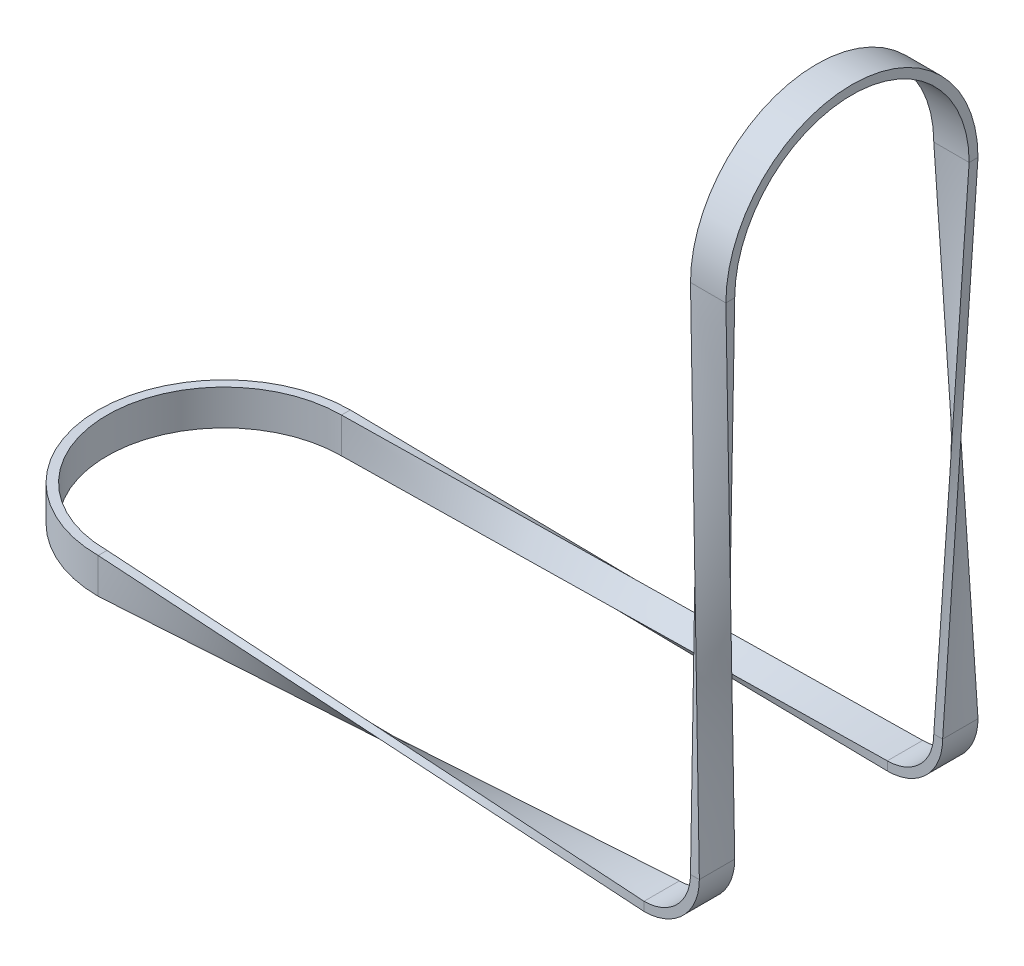
ISO-10303-21;
HEADER;
FILE_DESCRIPTION(('STEP AP214'),'2;1');
FILE_NAME('part.step','',(''),(''),'','','');
FILE_SCHEMA(('AUTOMOTIVE_DESIGN { 1 0 10303 214 1 1 1 1 }'));
ENDSEC;
DATA;
#1=APPLICATION_CONTEXT('core data for automotive mechanical design processes');
#2=APPLICATION_PROTOCOL_DEFINITION('international standard','automotive_design',2000,#1);
#3=PRODUCT_CONTEXT('',#1,'mechanical');
#4=PRODUCT('Part','Part','',(#3));
#5=PRODUCT_RELATED_PRODUCT_CATEGORY('part','',(#4));
#6=PRODUCT_DEFINITION_FORMATION('','',#4);
#7=PRODUCT_DEFINITION_CONTEXT('part definition',#1,'design');
#8=PRODUCT_DEFINITION('design','',#6,#7);
#9=PRODUCT_DEFINITION_SHAPE('','',#8);
#10=(LENGTH_UNIT() NAMED_UNIT(*) SI_UNIT(.MILLI.,.METRE.));
#11=(NAMED_UNIT(*) PLANE_ANGLE_UNIT() SI_UNIT($,.RADIAN.));
#12=(NAMED_UNIT(*) SI_UNIT($,.STERADIAN.) SOLID_ANGLE_UNIT());
#13=UNCERTAINTY_MEASURE_WITH_UNIT(LENGTH_MEASURE(1.E-05),#10,'distance_accuracy_value','');
#14=(GEOMETRIC_REPRESENTATION_CONTEXT(3) GLOBAL_UNCERTAINTY_ASSIGNED_CONTEXT((#13)) GLOBAL_UNIT_ASSIGNED_CONTEXT((#10,
#11,#12)) REPRESENTATION_CONTEXT('',''));
#15=CARTESIAN_POINT('',(0.,0.,0.));
#16=DIRECTION('',(0.,0.,1.));
#17=DIRECTION('',(1.,0.,0.));
#18=AXIS2_PLACEMENT_3D('',#15,#16,#17);
#19=CARTESIAN_POINT('',(-126.4,-7.50000000000002,28.5));
#20=CARTESIAN_POINT('',(0.,-12.5,31.5));
#21=CARTESIAN_POINT('',(-126.4,-8.83333333333336,28.5));
#22=CARTESIAN_POINT('',(0.,-12.5,30.1666666666667));
#23=CARTESIAN_POINT('',(-126.4,-10.1666666666667,28.5));
#24=CARTESIAN_POINT('',(0.,-12.5,28.8333333333333));
#25=CARTESIAN_POINT('',(-126.4,-12.8333333333334,28.5));
#26=CARTESIAN_POINT('',(0.,-12.5,26.1666666666667));
#27=CARTESIAN_POINT('',(-126.4,-14.1666666666667,28.5));
#28=CARTESIAN_POINT('',(0.,-12.5,24.8333333333333));
#29=CARTESIAN_POINT('',(-126.4,-15.5,28.5));
#30=CARTESIAN_POINT('',(0.,-12.5,23.5));
#31=B_SPLINE_SURFACE_WITH_KNOTS('',3,1,((#19,#20),(#21,#22),(#23,#24),(#25,#26),(#27,#28),(#29,
#30)),.UNSPECIFIED.,.F.,.F.,.F.,(4,2,4),(2,2),(0.,0.5,1.),(0.,1.),.UNSPECIFIED.);
#32=DIRECTION('',(0.,-1.,0.));
#33=VECTOR('',#32,1.);
#34=CARTESIAN_POINT('',(-126.4,-7.50000000000002,28.5));
#35=LINE('',#34,#33);
#36=CARTESIAN_POINT('',(-126.4,-7.50000000000002,28.5));
#37=VERTEX_POINT('',#36);
#38=CARTESIAN_POINT('',(-126.4,-10.4999999999992,28.5));
#39=VERTEX_POINT('',#38);
#40=EDGE_CURVE('E911',#37,#39,#35,.T.);
#41=DIRECTION('',(0.,1.,0.));
#42=VECTOR('',#41,1.);
#43=CARTESIAN_POINT('',(-126.4,-15.5,28.5));
#44=LINE('',#43,#42);
#45=CARTESIAN_POINT('',(-126.4,-15.5,28.5));
#46=VERTEX_POINT('',#45);
#47=EDGE_CURVE('E472',#46,#39,#44,.T.);
#48=DIRECTION('',(0.998937663034376,0.0237089635213857,-0.0395149392023091));
#49=VECTOR('',#48,1.);
#50=CARTESIAN_POINT('',(-63.2,-14.,26.));
#51=LINE('',#50,#49);
#52=CARTESIAN_POINT('',(0.,-12.5,23.5));
#53=VERTEX_POINT('',#52);
#54=EDGE_CURVE('E979',#46,#53,#51,.T.);
#55=DIRECTION('',(0.,0.,-1.));
#56=VECTOR('',#55,1.);
#57=CARTESIAN_POINT('',(0.,-12.5,31.5));
#58=LINE('',#57,#56);
#59=CARTESIAN_POINT('',(0.,-12.5,31.5));
#60=VERTEX_POINT('',#59);
#61=EDGE_CURVE('E386',#60,#53,#58,.T.);
#62=DIRECTION('',(-0.998937663034376,0.039514939202309,-0.0237089635213855));
#63=VECTOR('',#62,1.);
#64=CARTESIAN_POINT('',(-63.2,-10.,30.));
#65=LINE('',#64,#63);
#66=EDGE_CURVE('E461',#60,#37,#65,.T.);
#67=ORIENTED_EDGE('',*,*,#40,.T.);
#68=ORIENTED_EDGE('',*,*,#47,.F.);
#69=ORIENTED_EDGE('',*,*,#54,.T.);
#70=ORIENTED_EDGE('',*,*,#61,.F.);
#71=ORIENTED_EDGE('',*,*,#66,.T.);
#72=EDGE_LOOP('',(#67,#68,#69,#70,#71));
#73=FACE_BOUND('',#72,.T.);
#74=ADVANCED_FACE('F49',(#73),#31,.T.);
#75=CARTESIAN_POINT('',(-126.4,-15.5,28.5));
#76=CARTESIAN_POINT('',(0.,-12.5,23.5));
#77=CARTESIAN_POINT('',(-126.4,-15.5,28.1666666666667));
#78=CARTESIAN_POINT('',(0.,-12.1666666666667,23.5));
#79=CARTESIAN_POINT('',(-126.4,-15.5,27.8333333333333));
#80=CARTESIAN_POINT('',(0.,-11.8333333333333,23.5));
#81=CARTESIAN_POINT('',(-126.4,-15.5,27.1666666666666));
#82=CARTESIAN_POINT('',(0.,-11.1666666666667,23.5));
#83=CARTESIAN_POINT('',(-126.4,-15.5,26.8333333333333));
#84=CARTESIAN_POINT('',(0.,-10.8333333333333,23.5));
#85=CARTESIAN_POINT('',(-126.4,-15.5,26.5));
#86=CARTESIAN_POINT('',(0.,-10.5,23.5));
#87=B_SPLINE_SURFACE_WITH_KNOTS('',3,1,((#75,#76),(#77,#78),(#79,#80),(#81,#82),(#83,#84),(#85,
#86)),.UNSPECIFIED.,.F.,.F.,.F.,(4,2,4),(2,2),(0.,0.5,1.),(0.,1.),.UNSPECIFIED.);
#88=DIRECTION('',(0.,0.,-1.));
#89=VECTOR('',#88,1.);
#90=CARTESIAN_POINT('',(-126.4,-15.5,28.5));
#91=LINE('',#90,#89);
#92=CARTESIAN_POINT('',(-126.4,-15.5,26.5));
#93=VERTEX_POINT('',#92);
#94=EDGE_CURVE('E902',#46,#93,#91,.T.);
#95=DIRECTION('',(0.998937663034376,0.0395149392023093,-0.0237089635213855));
#96=VECTOR('',#95,1.);
#97=CARTESIAN_POINT('',(-63.2,-13.,25.));
#98=LINE('',#97,#96);
#99=CARTESIAN_POINT('',(0.,-10.5,23.5));
#100=VERTEX_POINT('',#99);
#101=EDGE_CURVE('E977',#93,#100,#98,.T.);
#102=DIRECTION('',(0.,-1.,0.));
#103=VECTOR('',#102,1.);
#104=CARTESIAN_POINT('',(0.,-10.5,23.5));
#105=LINE('',#104,#103);
#106=EDGE_CURVE('E61',#100,#53,#105,.T.);
#107=ORIENTED_EDGE('',*,*,#94,.T.);
#108=ORIENTED_EDGE('',*,*,#101,.T.);
#109=ORIENTED_EDGE('',*,*,#106,.T.);
#110=ORIENTED_EDGE('',*,*,#54,.F.);
#111=EDGE_LOOP('',(#107,#108,#109,#110));
#112=FACE_BOUND('',#111,.T.);
#113=ADVANCED_FACE('F445',(#112),#87,.T.);
#114=CARTESIAN_POINT('',(-126.4,-7.50000000000002,26.5));
#115=CARTESIAN_POINT('',(0.,-10.5,31.5));
#116=CARTESIAN_POINT('',(-126.4,-7.50000000000002,26.8333333333333));
#117=CARTESIAN_POINT('',(0.,-10.8333333333333,31.5));
#118=CARTESIAN_POINT('',(-126.4,-7.50000000000002,27.1666666666667));
#119=CARTESIAN_POINT('',(0.,-11.1666666666667,31.5));
#120=CARTESIAN_POINT('',(-126.4,-7.50000000000002,27.8333333333333));
#121=CARTESIAN_POINT('',(0.,-11.8333333333333,31.5));
#122=CARTESIAN_POINT('',(-126.4,-7.50000000000002,28.1666666666667));
#123=CARTESIAN_POINT('',(0.,-12.1666666666667,31.5));
#124=CARTESIAN_POINT('',(-126.4,-7.50000000000002,28.5));
#125=CARTESIAN_POINT('',(0.,-12.5,31.5));
#126=B_SPLINE_SURFACE_WITH_KNOTS('',3,1,((#114,#115),(#116,#117),(#118,#119),(#120,#121),(#122,
#123),(#124,#125)),.UNSPECIFIED.,.F.,.F.,.F.,(4,2,4),(2,2),(0.,0.5,1.),(0.,1.),.UNSPECIFIED.);
#127=DIRECTION('',(0.,0.,-1.));
#128=VECTOR('',#127,1.);
#129=CARTESIAN_POINT('',(-126.4,-7.50000000000002,28.5));
#130=LINE('',#129,#128);
#131=CARTESIAN_POINT('',(-126.4,-7.50000000000002,26.5));
#132=VERTEX_POINT('',#131);
#133=EDGE_CURVE('E378',#37,#132,#130,.T.);
#134=DIRECTION('',(0.,-1.,0.));
#135=VECTOR('',#134,1.);
#136=CARTESIAN_POINT('',(0.,-10.5,31.5));
#137=LINE('',#136,#135);
#138=CARTESIAN_POINT('',(0.,-10.5,31.5));
#139=VERTEX_POINT('',#138);
#140=EDGE_CURVE('E390',#139,#60,#137,.T.);
#141=DIRECTION('',(0.998937663034376,-0.0237089635213853,0.0395149392023092));
#142=VECTOR('',#141,1.);
#143=CARTESIAN_POINT('',(-63.2,-9.00000000000001,29.));
#144=LINE('',#143,#142);
#145=EDGE_CURVE('E394',#132,#139,#144,.T.);
#146=ORIENTED_EDGE('',*,*,#133,.F.);
#147=ORIENTED_EDGE('',*,*,#66,.F.);
#148=ORIENTED_EDGE('',*,*,#140,.F.);
#149=ORIENTED_EDGE('',*,*,#145,.F.);
#150=EDGE_LOOP('',(#146,#147,#148,#149));
#151=FACE_BOUND('',#150,.T.);
#152=ADVANCED_FACE('F974',(#151),#126,.T.);
#153=CARTESIAN_POINT('',(-126.4,-15.5,26.5));
#154=CARTESIAN_POINT('',(0.,-10.5,23.5));
#155=CARTESIAN_POINT('',(-126.4,-14.1666666666667,26.5));
#156=CARTESIAN_POINT('',(0.,-10.5,24.8333333333333));
#157=CARTESIAN_POINT('',(-126.4,-12.8333333333333,26.5));
#158=CARTESIAN_POINT('',(0.,-10.5,26.1666666666666));
#159=CARTESIAN_POINT('',(-126.4,-10.1666666666667,26.5));
#160=CARTESIAN_POINT('',(0.,-10.5,28.8333333333332));
#161=CARTESIAN_POINT('',(-126.4,-8.83333333333334,26.5));
#162=CARTESIAN_POINT('',(0.,-10.5,30.1666666666666));
#163=CARTESIAN_POINT('',(-126.4,-7.50000000000002,26.5));
#164=CARTESIAN_POINT('',(0.,-10.5,31.5));
#165=B_SPLINE_SURFACE_WITH_KNOTS('',3,1,((#153,#154),(#155,#156),(#157,#158),(#159,#160),(#161,
#162),(#163,#164)),.UNSPECIFIED.,.F.,.F.,.F.,(4,2,4),(2,2),(0.,0.5,1.),(0.,1.),.UNSPECIFIED.);
#166=DIRECTION('',(0.,-1.,0.));
#167=VECTOR('',#166,1.);
#168=CARTESIAN_POINT('',(-126.4,-7.50000000000002,26.5));
#169=LINE('',#168,#167);
#170=CARTESIAN_POINT('',(-126.4,-12.4999999999999,26.5));
#171=VERTEX_POINT('',#170);
#172=EDGE_CURVE('E912',#132,#171,#169,.T.);
#173=DIRECTION('',(0.,0.,-1.));
#174=VECTOR('',#173,1.);
#175=CARTESIAN_POINT('',(0.,-10.5,31.5));
#176=LINE('',#175,#174);
#177=EDGE_CURVE('E12',#139,#100,#176,.T.);
#178=EDGE_CURVE('E483',#171,#93,#169,.T.);
#179=ORIENTED_EDGE('',*,*,#172,.F.);
#180=ORIENTED_EDGE('',*,*,#145,.T.);
#181=ORIENTED_EDGE('',*,*,#177,.T.);
#182=ORIENTED_EDGE('',*,*,#101,.F.);
#183=ORIENTED_EDGE('',*,*,#178,.F.);
#184=EDGE_LOOP('',(#179,#180,#181,#182,#183));
#185=FACE_BOUND('',#184,.T.);
#186=ADVANCED_FACE('F51',(#185),#165,.T.);
#187=CARTESIAN_POINT('',(0.,0.,27.5));
#188=DIRECTION('',(0.,0.,-1.));
#189=DIRECTION('',(-1.,0.,0.));
#190=AXIS2_PLACEMENT_3D('',#187,#188,#189);
#191=CYLINDRICAL_SURFACE('',#190,10.5);
#192=CARTESIAN_POINT('',(0.,0.,23.5));
#193=DIRECTION('',(0.,0.,-1.));
#194=DIRECTION('',(1.,0.,0.));
#195=AXIS2_PLACEMENT_3D('',#192,#193,#194);
#196=CIRCLE('',#195,10.5);
#197=CARTESIAN_POINT('',(10.5,0.,23.5));
#198=VERTEX_POINT('',#197);
#199=EDGE_CURVE('E353',#198,#100,#196,.T.);
#200=ORIENTED_EDGE('',*,*,#199,.T.);
#201=ORIENTED_EDGE('',*,*,#177,.F.);
#202=CARTESIAN_POINT('',(0.,0.,31.5));
#203=DIRECTION('',(0.,0.,-1.));
#204=DIRECTION('',(1.,0.,0.));
#205=AXIS2_PLACEMENT_3D('',#202,#203,#204);
#206=CIRCLE('',#205,10.5);
#207=CARTESIAN_POINT('',(10.5,0.,31.5));
#208=VERTEX_POINT('',#207);
#209=EDGE_CURVE('E356',#208,#139,#206,.T.);
#210=ORIENTED_EDGE('',*,*,#209,.F.);
#211=DIRECTION('',(0.,0.,-1.));
#212=VECTOR('',#211,1.);
#213=CARTESIAN_POINT('',(10.5,0.,31.5));
#214=LINE('',#213,#212);
#215=EDGE_CURVE('E197',#208,#198,#214,.T.);
#216=ORIENTED_EDGE('',*,*,#215,.T.);
#217=EDGE_LOOP('',(#200,#201,#210,#216));
#218=FACE_BOUND('',#217,.T.);
#219=ADVANCED_FACE('F301',(#218),#191,.F.);
#220=CARTESIAN_POINT('',(10.5,0.,23.5));
#221=DIRECTION('',(0.,0.,-1.));
#222=DIRECTION('',(-1.,0.,0.));
#223=AXIS2_PLACEMENT_3D('',#220,#221,#222);
#224=PLANE('',#223);
#225=CARTESIAN_POINT('',(0.,0.,23.5));
#226=DIRECTION('',(0.,0.,-1.));
#227=DIRECTION('',(1.,0.,0.));
#228=AXIS2_PLACEMENT_3D('',#225,#226,#227);
#229=CIRCLE('',#228,12.5);
#230=CARTESIAN_POINT('',(12.5,0.,23.5));
#231=VERTEX_POINT('',#230);
#232=EDGE_CURVE('E363',#231,#53,#229,.T.);
#233=ORIENTED_EDGE('',*,*,#232,.T.);
#234=ORIENTED_EDGE('',*,*,#106,.F.);
#235=ORIENTED_EDGE('',*,*,#199,.F.);
#236=DIRECTION('',(1.,0.,0.));
#237=VECTOR('',#236,1.);
#238=CARTESIAN_POINT('',(10.5,0.,23.5));
#239=LINE('',#238,#237);
#240=EDGE_CURVE('E328',#198,#231,#239,.T.);
#241=ORIENTED_EDGE('',*,*,#240,.T.);
#242=EDGE_LOOP('',(#233,#234,#235,#241));
#243=FACE_BOUND('',#242,.T.);
#244=ADVANCED_FACE('F360',(#243),#224,.T.);
#245=CARTESIAN_POINT('',(0.,0.,27.5));
#246=DIRECTION('',(0.,0.,-1.));
#247=DIRECTION('',(-1.,0.,0.));
#248=AXIS2_PLACEMENT_3D('',#245,#246,#247);
#249=CYLINDRICAL_SURFACE('',#248,12.5);
#250=CARTESIAN_POINT('',(0.,0.,31.5));
#251=DIRECTION('',(0.,0.,-1.));
#252=DIRECTION('',(1.,0.,0.));
#253=AXIS2_PLACEMENT_3D('',#250,#251,#252);
#254=CIRCLE('',#253,12.5);
#255=CARTESIAN_POINT('',(12.5,0.,31.5));
#256=VERTEX_POINT('',#255);
#257=EDGE_CURVE('E365',#256,#60,#254,.T.);
#258=ORIENTED_EDGE('',*,*,#257,.T.);
#259=ORIENTED_EDGE('',*,*,#61,.T.);
#260=ORIENTED_EDGE('',*,*,#232,.F.);
#261=DIRECTION('',(0.,0.,1.));
#262=VECTOR('',#261,1.);
#263=CARTESIAN_POINT('',(12.5,0.,23.5));
#264=LINE('',#263,#262);
#265=EDGE_CURVE('E348',#231,#256,#264,.T.);
#266=ORIENTED_EDGE('',*,*,#265,.T.);
#267=EDGE_LOOP('',(#258,#259,#260,#266));
#268=FACE_BOUND('',#267,.T.);
#269=ADVANCED_FACE('F427',(#268),#249,.T.);
#270=CARTESIAN_POINT('',(12.5,0.,31.5));
#271=DIRECTION('',(0.,0.,1.));
#272=DIRECTION('',(1.,0.,0.));
#273=AXIS2_PLACEMENT_3D('',#270,#271,#272);
#274=PLANE('',#273);
#275=ORIENTED_EDGE('',*,*,#140,.T.);
#276=ORIENTED_EDGE('',*,*,#257,.F.);
#277=DIRECTION('',(-1.,0.,0.));
#278=VECTOR('',#277,1.);
#279=CARTESIAN_POINT('',(12.5,0.,31.5));
#280=LINE('',#279,#278);
#281=EDGE_CURVE('E240',#256,#208,#280,.T.);
#282=ORIENTED_EDGE('',*,*,#281,.T.);
#283=ORIENTED_EDGE('',*,*,#209,.T.);
#284=EDGE_LOOP('',(#275,#276,#282,#283));
#285=FACE_BOUND('',#284,.T.);
#286=ADVANCED_FACE('F300',(#285),#274,.T.);
#287=CARTESIAN_POINT('',(12.5,0.,31.5));
#288=CARTESIAN_POINT('',(7.5,112.9,28.5));
#289=CARTESIAN_POINT('',(12.5,0.,30.1666666666667));
#290=CARTESIAN_POINT('',(8.83333333333333,112.9,28.5));
#291=CARTESIAN_POINT('',(12.5,0.,28.8333333333333));
#292=CARTESIAN_POINT('',(10.1666666666667,112.9,28.5));
#293=CARTESIAN_POINT('',(12.5,0.,26.1666666666667));
#294=CARTESIAN_POINT('',(12.8333333333333,112.9,28.5));
#295=CARTESIAN_POINT('',(12.5,0.,24.8333333333333));
#296=CARTESIAN_POINT('',(14.1666666666667,112.9,28.5));
#297=CARTESIAN_POINT('',(12.5,0.,23.5));
#298=CARTESIAN_POINT('',(15.5,112.9,28.5));
#299=B_SPLINE_SURFACE_WITH_KNOTS('',3,1,((#287,#288),(#289,#290),(#291,#292),(#293,#294),(#295,
#296),(#297,#298)),.UNSPECIFIED.,.F.,.F.,.F.,(4,2,4),(2,2),(0.,0.5,1.),(0.,1.),.UNSPECIFIED.);
#300=DIRECTION('',(0.0265368189562791,0.998668953387968,0.0442280315937984));
#301=VECTOR('',#300,1.);
#302=CARTESIAN_POINT('',(14.,56.45,26.));
#303=LINE('',#302,#301);
#304=CARTESIAN_POINT('',(15.5,112.9,28.5));
#305=VERTEX_POINT('',#304);
#306=EDGE_CURVE('E232',#231,#305,#303,.T.);
#307=DIRECTION('',(1.,0.,0.));
#308=VECTOR('',#307,1.);
#309=CARTESIAN_POINT('',(7.5,112.9,28.5));
#310=LINE('',#309,#308);
#311=CARTESIAN_POINT('',(7.5,112.9,28.5));
#312=VERTEX_POINT('',#311);
#313=EDGE_CURVE('E221',#312,#305,#310,.T.);
#314=DIRECTION('',(0.0442280315937984,-0.998668953387968,0.026536818956279));
#315=VECTOR('',#314,1.);
#316=CARTESIAN_POINT('',(10.,56.45,30.));
#317=LINE('',#316,#315);
#318=EDGE_CURVE('E220',#312,#256,#317,.T.);
#319=ORIENTED_EDGE('',*,*,#265,.F.);
#320=ORIENTED_EDGE('',*,*,#306,.T.);
#321=ORIENTED_EDGE('',*,*,#313,.F.);
#322=ORIENTED_EDGE('',*,*,#318,.T.);
#323=EDGE_LOOP('',(#319,#320,#321,#322));
#324=FACE_BOUND('',#323,.T.);
#325=ADVANCED_FACE('F289',(#324),#299,.T.);
#326=CARTESIAN_POINT('',(12.5,0.,23.5));
#327=CARTESIAN_POINT('',(15.5,112.9,28.5));
#328=CARTESIAN_POINT('',(12.1666666666667,0.,23.5));
#329=CARTESIAN_POINT('',(15.5,112.9,28.1666666666667));
#330=CARTESIAN_POINT('',(11.8333333333333,0.,23.5));
#331=CARTESIAN_POINT('',(15.5,112.9,27.8333333333333));
#332=CARTESIAN_POINT('',(11.1666666666667,0.,23.5));
#333=CARTESIAN_POINT('',(15.5,112.9,27.1666666666667));
#334=CARTESIAN_POINT('',(10.8333333333333,0.,23.5));
#335=CARTESIAN_POINT('',(15.5,112.9,26.8333333333333));
#336=CARTESIAN_POINT('',(10.5,0.,23.5));
#337=CARTESIAN_POINT('',(15.5,112.9,26.5));
#338=B_SPLINE_SURFACE_WITH_KNOTS('',3,1,((#326,#327),(#328,#329),(#330,#331),(#332,#333),(#334,
#335),(#336,#337)),.UNSPECIFIED.,.F.,.F.,.F.,(4,2,4),(2,2),(0.,0.5,1.),(0.,1.),.UNSPECIFIED.);
#339=DIRECTION('',(0.0442280315937984,0.998668953387968,0.026536818956279));
#340=VECTOR('',#339,1.);
#341=CARTESIAN_POINT('',(13.,56.45,25.));
#342=LINE('',#341,#340);
#343=CARTESIAN_POINT('',(15.5,112.9,26.5));
#344=VERTEX_POINT('',#343);
#345=EDGE_CURVE('E229',#198,#344,#342,.T.);
#346=DIRECTION('',(0.,0.,1.));
#347=VECTOR('',#346,1.);
#348=CARTESIAN_POINT('',(15.5,112.9,26.5));
#349=LINE('',#348,#347);
#350=EDGE_CURVE('E198',#344,#305,#349,.T.);
#351=ORIENTED_EDGE('',*,*,#240,.F.);
#352=ORIENTED_EDGE('',*,*,#345,.T.);
#353=ORIENTED_EDGE('',*,*,#350,.T.);
#354=ORIENTED_EDGE('',*,*,#306,.F.);
#355=EDGE_LOOP('',(#351,#352,#353,#354));
#356=FACE_BOUND('',#355,.T.);
#357=ADVANCED_FACE('F257',(#356),#338,.T.);
#358=CARTESIAN_POINT('',(10.5,0.,31.5));
#359=CARTESIAN_POINT('',(7.5,112.9,26.5));
#360=CARTESIAN_POINT('',(10.8333333333333,0.,31.5));
#361=CARTESIAN_POINT('',(7.5,112.9,26.8333333333333));
#362=CARTESIAN_POINT('',(11.1666666666667,0.,31.5));
#363=CARTESIAN_POINT('',(7.5,112.9,27.1666666666667));
#364=CARTESIAN_POINT('',(11.8333333333333,0.,31.5));
#365=CARTESIAN_POINT('',(7.5,112.9,27.8333333333333));
#366=CARTESIAN_POINT('',(12.1666666666667,0.,31.5));
#367=CARTESIAN_POINT('',(7.5,112.9,28.1666666666667));
#368=CARTESIAN_POINT('',(12.5,0.,31.5));
#369=CARTESIAN_POINT('',(7.5,112.9,28.5));
#370=B_SPLINE_SURFACE_WITH_KNOTS('',3,1,((#358,#359),(#360,#361),(#362,#363),(#364,#365),(#366,
#367),(#368,#369)),.UNSPECIFIED.,.F.,.F.,.F.,(4,2,4),(2,2),(0.,0.5,1.),(0.,1.),.UNSPECIFIED.);
#371=DIRECTION('',(0.,0.,1.));
#372=VECTOR('',#371,1.);
#373=CARTESIAN_POINT('',(7.5,112.9,26.5));
#374=LINE('',#373,#372);
#375=CARTESIAN_POINT('',(7.5,112.9,26.5));
#376=VERTEX_POINT('',#375);
#377=EDGE_CURVE('E206',#376,#312,#374,.T.);
#378=DIRECTION('',(-0.026536818956279,0.998668953387968,-0.0442280315937984));
#379=VECTOR('',#378,1.);
#380=CARTESIAN_POINT('',(9.,56.45,29.));
#381=LINE('',#380,#379);
#382=EDGE_CURVE('E217',#208,#376,#381,.T.);
#383=ORIENTED_EDGE('',*,*,#281,.F.);
#384=ORIENTED_EDGE('',*,*,#318,.F.);
#385=ORIENTED_EDGE('',*,*,#377,.F.);
#386=ORIENTED_EDGE('',*,*,#382,.F.);
#387=EDGE_LOOP('',(#383,#384,#385,#386));
#388=FACE_BOUND('',#387,.T.);
#389=ADVANCED_FACE('F216',(#388),#370,.T.);
#390=CARTESIAN_POINT('',(10.5,0.,23.5));
#391=CARTESIAN_POINT('',(15.5,112.9,26.5));
#392=CARTESIAN_POINT('',(10.5,0.,24.8333333333333));
#393=CARTESIAN_POINT('',(14.1666666666667,112.9,26.5));
#394=CARTESIAN_POINT('',(10.5,0.,26.1666666666666));
#395=CARTESIAN_POINT('',(12.8333333333333,112.9,26.5));
#396=CARTESIAN_POINT('',(10.5,0.,28.8333333333332));
#397=CARTESIAN_POINT('',(10.1666666666667,112.9,26.5));
#398=CARTESIAN_POINT('',(10.5,0.,30.1666666666666));
#399=CARTESIAN_POINT('',(8.83333333333334,112.9,26.5));
#400=CARTESIAN_POINT('',(10.5,0.,31.5));
#401=CARTESIAN_POINT('',(7.5,112.9,26.5));
#402=B_SPLINE_SURFACE_WITH_KNOTS('',3,1,((#390,#391),(#392,#393),(#394,#395),(#396,#397),(#398,
#399),(#400,#401)),.UNSPECIFIED.,.F.,.F.,.F.,(4,2,4),(2,2),(0.,0.5,1.),(0.,1.),.UNSPECIFIED.);
#403=DIRECTION('',(1.,0.,0.));
#404=VECTOR('',#403,1.);
#405=CARTESIAN_POINT('',(7.5,112.9,26.5));
#406=LINE('',#405,#404);
#407=EDGE_CURVE('E184',#376,#344,#406,.T.);
#408=ORIENTED_EDGE('',*,*,#215,.F.);
#409=ORIENTED_EDGE('',*,*,#382,.T.);
#410=ORIENTED_EDGE('',*,*,#407,.T.);
#411=ORIENTED_EDGE('',*,*,#345,.F.);
#412=EDGE_LOOP('',(#408,#409,#410,#411));
#413=FACE_BOUND('',#412,.T.);
#414=ADVANCED_FACE('F225',(#413),#402,.T.);
#415=CARTESIAN_POINT('',(-126.4,-11.5,0.));
#416=DIRECTION('',(0.,-1.,0.));
#417=DIRECTION('',(0.,0.,-1.));
#418=AXIS2_PLACEMENT_3D('',#415,#416,#417);
#419=CYLINDRICAL_SURFACE('',#418,28.5);
#420=CARTESIAN_POINT('',(-126.4,-7.50000000000002,0.));
#421=DIRECTION('',(0.,-1.,0.));
#422=DIRECTION('',(0.,0.,1.));
#423=AXIS2_PLACEMENT_3D('',#420,#421,#422);
#424=CIRCLE('',#423,28.5);
#425=CARTESIAN_POINT('',(-126.4,-7.50000000000002,-28.5));
#426=VERTEX_POINT('',#425);
#427=EDGE_CURVE('E894',#37,#426,#424,.T.);
#428=ORIENTED_EDGE('',*,*,#427,.T.);
#429=DIRECTION('',(0.,-1.,0.));
#430=VECTOR('',#429,1.);
#431=CARTESIAN_POINT('',(-126.4,-7.50000000000002,-28.5));
#432=LINE('',#431,#430);
#433=CARTESIAN_POINT('',(-126.4,-10.4999999999992,-28.5));
#434=VERTEX_POINT('',#433);
#435=EDGE_CURVE('E69',#426,#434,#432,.T.);
#436=ORIENTED_EDGE('',*,*,#435,.T.);
#437=DIRECTION('',(0.,1.,0.));
#438=VECTOR('',#437,1.);
#439=CARTESIAN_POINT('',(-126.4,-15.5,-28.5));
#440=LINE('',#439,#438);
#441=CARTESIAN_POINT('',(-126.4,-15.5,-28.5));
#442=VERTEX_POINT('',#441);
#443=EDGE_CURVE('E741',#442,#434,#440,.T.);
#444=ORIENTED_EDGE('',*,*,#443,.F.);
#445=CARTESIAN_POINT('',(-126.4,-15.5,0.));
#446=DIRECTION('',(0.,-1.,0.));
#447=DIRECTION('',(0.,0.,1.));
#448=AXIS2_PLACEMENT_3D('',#445,#446,#447);
#449=CIRCLE('',#448,28.5);
#450=EDGE_CURVE('E891',#46,#442,#449,.T.);
#451=ORIENTED_EDGE('',*,*,#450,.F.);
#452=ORIENTED_EDGE('',*,*,#47,.T.);
#453=ORIENTED_EDGE('',*,*,#40,.F.);
#454=EDGE_LOOP('',(#428,#436,#444,#451,#452,#453));
#455=FACE_BOUND('',#454,.T.);
#456=ADVANCED_FACE('F636',(#455),#419,.T.);
#457=CARTESIAN_POINT('',(-126.4,-7.50000000000002,28.5));
#458=DIRECTION('',(0.,1.,0.));
#459=DIRECTION('',(0.,0.,1.));
#460=AXIS2_PLACEMENT_3D('',#457,#458,#459);
#461=PLANE('',#460);
#462=CARTESIAN_POINT('',(-126.4,-7.50000000000002,0.));
#463=DIRECTION('',(0.,-1.,0.));
#464=DIRECTION('',(0.,0.,1.));
#465=AXIS2_PLACEMENT_3D('',#462,#463,#464);
#466=CIRCLE('',#465,26.5);
#467=CARTESIAN_POINT('',(-126.4,-7.50000000000002,-26.5));
#468=VERTEX_POINT('',#467);
#469=EDGE_CURVE('E933',#132,#468,#466,.T.);
#470=ORIENTED_EDGE('',*,*,#469,.T.);
#471=DIRECTION('',(0.,0.,1.));
#472=VECTOR('',#471,1.);
#473=CARTESIAN_POINT('',(-126.4,-7.50000000000002,-28.5));
#474=LINE('',#473,#472);
#475=EDGE_CURVE('E873',#426,#468,#474,.T.);
#476=ORIENTED_EDGE('',*,*,#475,.F.);
#477=ORIENTED_EDGE('',*,*,#427,.F.);
#478=ORIENTED_EDGE('',*,*,#133,.T.);
#479=EDGE_LOOP('',(#470,#476,#477,#478));
#480=FACE_BOUND('',#479,.T.);
#481=ADVANCED_FACE('F498',(#480),#461,.T.);
#482=CARTESIAN_POINT('',(-126.4,-11.5,0.));
#483=DIRECTION('',(0.,-1.,0.));
#484=DIRECTION('',(0.,0.,-1.));
#485=AXIS2_PLACEMENT_3D('',#482,#483,#484);
#486=CYLINDRICAL_SURFACE('',#485,26.5);
#487=CARTESIAN_POINT('',(-126.4,-15.5,0.));
#488=DIRECTION('',(0.,-1.,0.));
#489=DIRECTION('',(0.,0.,1.));
#490=AXIS2_PLACEMENT_3D('',#487,#488,#489);
#491=CIRCLE('',#490,26.5);
#492=CARTESIAN_POINT('',(-126.4,-15.5,-26.5));
#493=VERTEX_POINT('',#492);
#494=EDGE_CURVE('E474',#93,#493,#491,.T.);
#495=ORIENTED_EDGE('',*,*,#494,.T.);
#496=DIRECTION('',(0.,-1.,0.));
#497=VECTOR('',#496,1.);
#498=CARTESIAN_POINT('',(-126.4,-7.50000000000002,-26.5));
#499=LINE('',#498,#497);
#500=CARTESIAN_POINT('',(-126.4,-12.4999999999999,-26.5));
#501=VERTEX_POINT('',#500);
#502=EDGE_CURVE('E78',#501,#493,#499,.T.);
#503=ORIENTED_EDGE('',*,*,#502,.F.);
#504=DIRECTION('',(0.,-1.,0.));
#505=VECTOR('',#504,1.);
#506=CARTESIAN_POINT('',(-126.4,-7.50000000000002,-26.5));
#507=LINE('',#506,#505);
#508=EDGE_CURVE('E477',#468,#501,#507,.T.);
#509=ORIENTED_EDGE('',*,*,#508,.F.);
#510=ORIENTED_EDGE('',*,*,#469,.F.);
#511=ORIENTED_EDGE('',*,*,#172,.T.);
#512=ORIENTED_EDGE('',*,*,#178,.T.);
#513=EDGE_LOOP('',(#495,#503,#509,#510,#511,#512));
#514=FACE_BOUND('',#513,.T.);
#515=ADVANCED_FACE('F489',(#514),#486,.F.);
#516=CARTESIAN_POINT('',(-126.4,-15.5,26.5));
#517=DIRECTION('',(0.,-1.,0.));
#518=DIRECTION('',(0.,0.,-1.));
#519=AXIS2_PLACEMENT_3D('',#516,#517,#518);
#520=PLANE('',#519);
#521=DIRECTION('',(0.,0.,-1.));
#522=VECTOR('',#521,1.);
#523=CARTESIAN_POINT('',(-126.4,-15.5,-26.5));
#524=LINE('',#523,#522);
#525=EDGE_CURVE('E476',#493,#442,#524,.T.);
#526=ORIENTED_EDGE('',*,*,#525,.F.);
#527=ORIENTED_EDGE('',*,*,#494,.F.);
#528=ORIENTED_EDGE('',*,*,#94,.F.);
#529=ORIENTED_EDGE('',*,*,#450,.T.);
#530=EDGE_LOOP('',(#526,#527,#528,#529));
#531=FACE_BOUND('',#530,.T.);
#532=ADVANCED_FACE('F302',(#531),#520,.T.);
#533=CARTESIAN_POINT('',(-126.4,-7.50000000000002,-28.5));
#534=CARTESIAN_POINT('',(0.,-12.5,-31.5));
#535=CARTESIAN_POINT('',(-126.4,-8.83333333333336,-28.5));
#536=CARTESIAN_POINT('',(0.,-12.5,-30.1666666666667));
#537=CARTESIAN_POINT('',(-126.4,-10.1666666666667,-28.5));
#538=CARTESIAN_POINT('',(0.,-12.5,-28.8333333333333));
#539=CARTESIAN_POINT('',(-126.4,-12.8333333333334,-28.5));
#540=CARTESIAN_POINT('',(0.,-12.5,-26.1666666666667));
#541=CARTESIAN_POINT('',(-126.4,-14.1666666666667,-28.5));
#542=CARTESIAN_POINT('',(0.,-12.5,-24.8333333333333));
#543=CARTESIAN_POINT('',(-126.4,-15.5,-28.5));
#544=CARTESIAN_POINT('',(0.,-12.5,-23.5));
#545=B_SPLINE_SURFACE_WITH_KNOTS('',3,1,((#533,#534),(#535,#536),(#537,#538),(#539,#540),(#541,
#542),(#543,#544)),.UNSPECIFIED.,.F.,.F.,.F.,(4,2,4),(2,2),(0.,0.5,1.),(0.,1.),.UNSPECIFIED.);
#546=DIRECTION('',(-0.998937663034376,0.039514939202309,0.0237089635213855));
#547=VECTOR('',#546,1.);
#548=CARTESIAN_POINT('',(-63.2,-10.,-30.));
#549=LINE('',#548,#547);
#550=CARTESIAN_POINT('',(0.,-12.5,-31.5));
#551=VERTEX_POINT('',#550);
#552=EDGE_CURVE('E651',#551,#426,#549,.T.);
#553=DIRECTION('',(0.,0.,1.));
#554=VECTOR('',#553,1.);
#555=CARTESIAN_POINT('',(0.,-12.5,-31.5));
#556=LINE('',#555,#554);
#557=CARTESIAN_POINT('',(0.,-12.5,-23.5));
#558=VERTEX_POINT('',#557);
#559=EDGE_CURVE('E551',#551,#558,#556,.T.);
#560=DIRECTION('',(0.998937663034376,0.0237089635213857,0.0395149392023091));
#561=VECTOR('',#560,1.);
#562=CARTESIAN_POINT('',(-63.2,-14.,-26.));
#563=LINE('',#562,#561);
#564=EDGE_CURVE('E660',#442,#558,#563,.T.);
#565=ORIENTED_EDGE('',*,*,#435,.F.);
#566=ORIENTED_EDGE('',*,*,#552,.F.);
#567=ORIENTED_EDGE('',*,*,#559,.T.);
#568=ORIENTED_EDGE('',*,*,#564,.F.);
#569=ORIENTED_EDGE('',*,*,#443,.T.);
#570=EDGE_LOOP('',(#565,#566,#567,#568,#569));
#571=FACE_BOUND('',#570,.T.);
#572=ADVANCED_FACE('F628',(#571),#545,.F.);
#573=CARTESIAN_POINT('',(-126.4,-15.5,-28.5));
#574=CARTESIAN_POINT('',(0.,-12.5,-23.5));
#575=CARTESIAN_POINT('',(-126.4,-15.5,-28.1666666666667));
#576=CARTESIAN_POINT('',(0.,-12.1666666666667,-23.5));
#577=CARTESIAN_POINT('',(-126.4,-15.5,-27.8333333333333));
#578=CARTESIAN_POINT('',(0.,-11.8333333333333,-23.5));
#579=CARTESIAN_POINT('',(-126.4,-15.5,-27.1666666666666));
#580=CARTESIAN_POINT('',(0.,-11.1666666666667,-23.5));
#581=CARTESIAN_POINT('',(-126.4,-15.5,-26.8333333333333));
#582=CARTESIAN_POINT('',(0.,-10.8333333333333,-23.5));
#583=CARTESIAN_POINT('',(-126.4,-15.5,-26.5));
#584=CARTESIAN_POINT('',(0.,-10.5,-23.5));
#585=B_SPLINE_SURFACE_WITH_KNOTS('',3,1,((#573,#574),(#575,#576),(#577,#578),(#579,#580),(#581,
#582),(#583,#584)),.UNSPECIFIED.,.F.,.F.,.F.,(4,2,4),(2,2),(0.,0.5,1.),(0.,1.),.UNSPECIFIED.);
#586=DIRECTION('',(0.,-1.,0.));
#587=VECTOR('',#586,1.);
#588=CARTESIAN_POINT('',(0.,-10.5,-23.5));
#589=LINE('',#588,#587);
#590=CARTESIAN_POINT('',(0.,-10.5,-23.5));
#591=VERTEX_POINT('',#590);
#592=EDGE_CURVE('E546',#591,#558,#589,.T.);
#593=DIRECTION('',(0.998937663034376,0.0395149392023093,0.0237089635213855));
#594=VECTOR('',#593,1.);
#595=CARTESIAN_POINT('',(-63.2,-13.,-25.));
#596=LINE('',#595,#594);
#597=EDGE_CURVE('E665',#493,#591,#596,.T.);
#598=ORIENTED_EDGE('',*,*,#525,.T.);
#599=ORIENTED_EDGE('',*,*,#564,.T.);
#600=ORIENTED_EDGE('',*,*,#592,.F.);
#601=ORIENTED_EDGE('',*,*,#597,.F.);
#602=EDGE_LOOP('',(#598,#599,#600,#601));
#603=FACE_BOUND('',#602,.T.);
#604=ADVANCED_FACE('F634',(#603),#585,.F.);
#605=CARTESIAN_POINT('',(-126.4,-7.50000000000002,-26.5));
#606=CARTESIAN_POINT('',(0.,-10.5,-31.5));
#607=CARTESIAN_POINT('',(-126.4,-7.50000000000002,-26.8333333333333));
#608=CARTESIAN_POINT('',(0.,-10.8333333333333,-31.5));
#609=CARTESIAN_POINT('',(-126.4,-7.50000000000002,-27.1666666666667));
#610=CARTESIAN_POINT('',(0.,-11.1666666666667,-31.5));
#611=CARTESIAN_POINT('',(-126.4,-7.50000000000002,-27.8333333333333));
#612=CARTESIAN_POINT('',(0.,-11.8333333333333,-31.5));
#613=CARTESIAN_POINT('',(-126.4,-7.50000000000002,-28.1666666666667));
#614=CARTESIAN_POINT('',(0.,-12.1666666666667,-31.5));
#615=CARTESIAN_POINT('',(-126.4,-7.50000000000002,-28.5));
#616=CARTESIAN_POINT('',(0.,-12.5,-31.5));
#617=B_SPLINE_SURFACE_WITH_KNOTS('',3,1,((#605,#606),(#607,#608),(#609,#610),(#611,#612),(#613,
#614),(#615,#616)),.UNSPECIFIED.,.F.,.F.,.F.,(4,2,4),(2,2),(0.,0.5,1.),(0.,1.),.UNSPECIFIED.);
#618=DIRECTION('',(0.998937663034376,-0.0237089635213853,-0.0395149392023092));
#619=VECTOR('',#618,1.);
#620=CARTESIAN_POINT('',(-63.2,-9.00000000000001,-29.));
#621=LINE('',#620,#619);
#622=CARTESIAN_POINT('',(0.,-10.5,-31.5));
#623=VERTEX_POINT('',#622);
#624=EDGE_CURVE('E561',#468,#623,#621,.T.);
#625=DIRECTION('',(0.,-1.,0.));
#626=VECTOR('',#625,1.);
#627=CARTESIAN_POINT('',(0.,-10.5,-31.5));
#628=LINE('',#627,#626);
#629=EDGE_CURVE('E556',#623,#551,#628,.T.);
#630=ORIENTED_EDGE('',*,*,#475,.T.);
#631=ORIENTED_EDGE('',*,*,#624,.T.);
#632=ORIENTED_EDGE('',*,*,#629,.T.);
#633=ORIENTED_EDGE('',*,*,#552,.T.);
#634=EDGE_LOOP('',(#630,#631,#632,#633));
#635=FACE_BOUND('',#634,.T.);
#636=ADVANCED_FACE('F704',(#635),#617,.F.);
#637=CARTESIAN_POINT('',(-126.4,-15.5,-26.5));
#638=CARTESIAN_POINT('',(0.,-10.5,-23.5));
#639=CARTESIAN_POINT('',(-126.4,-14.1666666666667,-26.5));
#640=CARTESIAN_POINT('',(0.,-10.5,-24.8333333333333));
#641=CARTESIAN_POINT('',(-126.4,-12.8333333333333,-26.5));
#642=CARTESIAN_POINT('',(0.,-10.5,-26.1666666666666));
#643=CARTESIAN_POINT('',(-126.4,-10.1666666666667,-26.5));
#644=CARTESIAN_POINT('',(0.,-10.5,-28.8333333333332));
#645=CARTESIAN_POINT('',(-126.4,-8.83333333333334,-26.5));
#646=CARTESIAN_POINT('',(0.,-10.5,-30.1666666666666));
#647=CARTESIAN_POINT('',(-126.4,-7.50000000000002,-26.5));
#648=CARTESIAN_POINT('',(0.,-10.5,-31.5));
#649=B_SPLINE_SURFACE_WITH_KNOTS('',3,1,((#637,#638),(#639,#640),(#641,#642),(#643,#644),(#645,
#646),(#647,#648)),.UNSPECIFIED.,.F.,.F.,.F.,(4,2,4),(2,2),(0.,0.5,1.),(0.,1.),.UNSPECIFIED.);
#650=DIRECTION('',(0.,0.,1.));
#651=VECTOR('',#650,1.);
#652=CARTESIAN_POINT('',(0.,-10.5,-31.5));
#653=LINE('',#652,#651);
#654=EDGE_CURVE('E543',#623,#591,#653,.T.);
#655=ORIENTED_EDGE('',*,*,#508,.T.);
#656=ORIENTED_EDGE('',*,*,#502,.T.);
#657=ORIENTED_EDGE('',*,*,#597,.T.);
#658=ORIENTED_EDGE('',*,*,#654,.F.);
#659=ORIENTED_EDGE('',*,*,#624,.F.);
#660=EDGE_LOOP('',(#655,#656,#657,#658,#659));
#661=FACE_BOUND('',#660,.T.);
#662=ADVANCED_FACE('F693',(#661),#649,.F.);
#663=CARTESIAN_POINT('',(0.,0.,-27.5));
#664=DIRECTION('',(0.,0.,1.));
#665=DIRECTION('',(-1.,0.,0.));
#666=AXIS2_PLACEMENT_3D('',#663,#664,#665);
#667=CYLINDRICAL_SURFACE('',#666,10.5);
#668=CARTESIAN_POINT('',(0.,0.,-23.5));
#669=DIRECTION('',(0.,0.,-1.));
#670=DIRECTION('',(1.,0.,0.));
#671=AXIS2_PLACEMENT_3D('',#668,#669,#670);
#672=CIRCLE('',#671,10.5);
#673=CARTESIAN_POINT('',(10.5,0.,-23.5));
#674=VERTEX_POINT('',#673);
#675=EDGE_CURVE('E527',#674,#591,#672,.T.);
#676=ORIENTED_EDGE('',*,*,#675,.F.);
#677=DIRECTION('',(0.,0.,1.));
#678=VECTOR('',#677,1.);
#679=CARTESIAN_POINT('',(10.5,0.,-31.5));
#680=LINE('',#679,#678);
#681=CARTESIAN_POINT('',(10.5,0.,-31.5));
#682=VERTEX_POINT('',#681);
#683=EDGE_CURVE('E577',#682,#674,#680,.T.);
#684=ORIENTED_EDGE('',*,*,#683,.F.);
#685=CARTESIAN_POINT('',(0.,0.,-31.5));
#686=DIRECTION('',(0.,0.,-1.));
#687=DIRECTION('',(1.,0.,0.));
#688=AXIS2_PLACEMENT_3D('',#685,#686,#687);
#689=CIRCLE('',#688,10.5);
#690=EDGE_CURVE('E530',#682,#623,#689,.T.);
#691=ORIENTED_EDGE('',*,*,#690,.T.);
#692=ORIENTED_EDGE('',*,*,#654,.T.);
#693=EDGE_LOOP('',(#676,#684,#691,#692));
#694=FACE_BOUND('',#693,.T.);
#695=ADVANCED_FACE('F703',(#694),#667,.F.);
#696=CARTESIAN_POINT('',(10.5,0.,-23.5));
#697=DIRECTION('',(0.,0.,1.));
#698=DIRECTION('',(-1.,0.,0.));
#699=AXIS2_PLACEMENT_3D('',#696,#697,#698);
#700=PLANE('',#699);
#701=CARTESIAN_POINT('',(0.,0.,-23.5));
#702=DIRECTION('',(0.,0.,-1.));
#703=DIRECTION('',(1.,0.,0.));
#704=AXIS2_PLACEMENT_3D('',#701,#702,#703);
#705=CIRCLE('',#704,12.5);
#706=CARTESIAN_POINT('',(12.5,0.,-23.5));
#707=VERTEX_POINT('',#706);
#708=EDGE_CURVE('E529',#707,#558,#705,.T.);
#709=ORIENTED_EDGE('',*,*,#708,.F.);
#710=DIRECTION('',(1.,0.,0.));
#711=VECTOR('',#710,1.);
#712=CARTESIAN_POINT('',(10.5,0.,-23.5));
#713=LINE('',#712,#711);
#714=EDGE_CURVE('E567',#674,#707,#713,.T.);
#715=ORIENTED_EDGE('',*,*,#714,.F.);
#716=ORIENTED_EDGE('',*,*,#675,.T.);
#717=ORIENTED_EDGE('',*,*,#592,.T.);
#718=EDGE_LOOP('',(#709,#715,#716,#717));
#719=FACE_BOUND('',#718,.T.);
#720=ADVANCED_FACE('F621',(#719),#700,.T.);
#721=CARTESIAN_POINT('',(0.,0.,-27.5));
#722=DIRECTION('',(0.,0.,1.));
#723=DIRECTION('',(-1.,0.,0.));
#724=AXIS2_PLACEMENT_3D('',#721,#722,#723);
#725=CYLINDRICAL_SURFACE('',#724,12.5);
#726=CARTESIAN_POINT('',(0.,0.,-31.5));
#727=DIRECTION('',(0.,0.,-1.));
#728=DIRECTION('',(1.,0.,0.));
#729=AXIS2_PLACEMENT_3D('',#726,#727,#728);
#730=CIRCLE('',#729,12.5);
#731=CARTESIAN_POINT('',(12.5,0.,-31.5));
#732=VERTEX_POINT('',#731);
#733=EDGE_CURVE('E521',#732,#551,#730,.T.);
#734=ORIENTED_EDGE('',*,*,#733,.F.);
#735=DIRECTION('',(0.,0.,-1.));
#736=VECTOR('',#735,1.);
#737=CARTESIAN_POINT('',(12.5,0.,-23.5));
#738=LINE('',#737,#736);
#739=EDGE_CURVE('E564',#707,#732,#738,.T.);
#740=ORIENTED_EDGE('',*,*,#739,.F.);
#741=ORIENTED_EDGE('',*,*,#708,.T.);
#742=ORIENTED_EDGE('',*,*,#559,.F.);
#743=EDGE_LOOP('',(#734,#740,#741,#742));
#744=FACE_BOUND('',#743,.T.);
#745=ADVANCED_FACE('F612',(#744),#725,.T.);
#746=CARTESIAN_POINT('',(12.5,0.,-31.5));
#747=DIRECTION('',(0.,0.,-1.));
#748=DIRECTION('',(1.,0.,0.));
#749=AXIS2_PLACEMENT_3D('',#746,#747,#748);
#750=PLANE('',#749);
#751=ORIENTED_EDGE('',*,*,#629,.F.);
#752=ORIENTED_EDGE('',*,*,#690,.F.);
#753=DIRECTION('',(-1.,0.,0.));
#754=VECTOR('',#753,1.);
#755=CARTESIAN_POINT('',(12.5,0.,-31.5));
#756=LINE('',#755,#754);
#757=EDGE_CURVE('E534',#732,#682,#756,.T.);
#758=ORIENTED_EDGE('',*,*,#757,.F.);
#759=ORIENTED_EDGE('',*,*,#733,.T.);
#760=EDGE_LOOP('',(#751,#752,#758,#759));
#761=FACE_BOUND('',#760,.T.);
#762=ADVANCED_FACE('F620',(#761),#750,.T.);
#763=CARTESIAN_POINT('',(12.5,0.,-31.5));
#764=CARTESIAN_POINT('',(7.5,112.9,-28.5));
#765=CARTESIAN_POINT('',(12.5,0.,-30.1666666666667));
#766=CARTESIAN_POINT('',(8.83333333333333,112.9,-28.5));
#767=CARTESIAN_POINT('',(12.5,0.,-28.8333333333333));
#768=CARTESIAN_POINT('',(10.1666666666667,112.9,-28.5));
#769=CARTESIAN_POINT('',(12.5,0.,-26.1666666666667));
#770=CARTESIAN_POINT('',(12.8333333333333,112.9,-28.5));
#771=CARTESIAN_POINT('',(12.5,0.,-24.8333333333333));
#772=CARTESIAN_POINT('',(14.1666666666667,112.9,-28.5));
#773=CARTESIAN_POINT('',(12.5,0.,-23.5));
#774=CARTESIAN_POINT('',(15.5,112.9,-28.5));
#775=B_SPLINE_SURFACE_WITH_KNOTS('',3,1,((#763,#764),(#765,#766),(#767,#768),(#769,#770),(#771,
#772),(#773,#774)),.UNSPECIFIED.,.F.,.F.,.F.,(4,2,4),(2,2),(0.,0.5,1.),(0.,1.),.UNSPECIFIED.);
#776=DIRECTION('',(0.0442280315937984,-0.998668953387968,-0.026536818956279));
#777=VECTOR('',#776,1.);
#778=CARTESIAN_POINT('',(10.,56.45,-30.));
#779=LINE('',#778,#777);
#780=CARTESIAN_POINT('',(7.5,112.9,-28.5));
#781=VERTEX_POINT('',#780);
#782=EDGE_CURVE('E753',#781,#732,#779,.T.);
#783=DIRECTION('',(1.,0.,0.));
#784=VECTOR('',#783,1.);
#785=CARTESIAN_POINT('',(7.5,112.9,-28.5));
#786=LINE('',#785,#784);
#787=CARTESIAN_POINT('',(15.5,112.9,-28.5));
#788=VERTEX_POINT('',#787);
#789=EDGE_CURVE('E783',#781,#788,#786,.T.);
#790=DIRECTION('',(0.0265368189562791,0.998668953387968,-0.0442280315937984));
#791=VECTOR('',#790,1.);
#792=CARTESIAN_POINT('',(14.,56.45,-26.));
#793=LINE('',#792,#791);
#794=EDGE_CURVE('E779',#707,#788,#793,.T.);
#795=ORIENTED_EDGE('',*,*,#739,.T.);
#796=ORIENTED_EDGE('',*,*,#782,.F.);
#797=ORIENTED_EDGE('',*,*,#789,.T.);
#798=ORIENTED_EDGE('',*,*,#794,.F.);
#799=EDGE_LOOP('',(#795,#796,#797,#798));
#800=FACE_BOUND('',#799,.T.);
#801=ADVANCED_FACE('F626',(#800),#775,.F.);
#802=CARTESIAN_POINT('',(12.5,0.,-23.5));
#803=CARTESIAN_POINT('',(15.5,112.9,-28.5));
#804=CARTESIAN_POINT('',(12.1666666666667,0.,-23.5));
#805=CARTESIAN_POINT('',(15.5,112.9,-28.1666666666667));
#806=CARTESIAN_POINT('',(11.8333333333333,0.,-23.5));
#807=CARTESIAN_POINT('',(15.5,112.9,-27.8333333333333));
#808=CARTESIAN_POINT('',(11.1666666666667,0.,-23.5));
#809=CARTESIAN_POINT('',(15.5,112.9,-27.1666666666667));
#810=CARTESIAN_POINT('',(10.8333333333333,0.,-23.5));
#811=CARTESIAN_POINT('',(15.5,112.9,-26.8333333333333));
#812=CARTESIAN_POINT('',(10.5,0.,-23.5));
#813=CARTESIAN_POINT('',(15.5,112.9,-26.5));
#814=B_SPLINE_SURFACE_WITH_KNOTS('',3,1,((#802,#803),(#804,#805),(#806,#807),(#808,#809),(#810,
#811),(#812,#813)),.UNSPECIFIED.,.F.,.F.,.F.,(4,2,4),(2,2),(0.,0.5,1.),(0.,1.),.UNSPECIFIED.);
#815=DIRECTION('',(0.,0.,-1.));
#816=VECTOR('',#815,1.);
#817=CARTESIAN_POINT('',(15.5,112.9,-26.5));
#818=LINE('',#817,#816);
#819=CARTESIAN_POINT('',(15.5,112.9,-26.5));
#820=VERTEX_POINT('',#819);
#821=EDGE_CURVE('E768',#820,#788,#818,.T.);
#822=DIRECTION('',(0.0442280315937984,0.998668953387968,-0.026536818956279));
#823=VECTOR('',#822,1.);
#824=CARTESIAN_POINT('',(13.,56.45,-25.));
#825=LINE('',#824,#823);
#826=EDGE_CURVE('E773',#674,#820,#825,.T.);
#827=ORIENTED_EDGE('',*,*,#714,.T.);
#828=ORIENTED_EDGE('',*,*,#794,.T.);
#829=ORIENTED_EDGE('',*,*,#821,.F.);
#830=ORIENTED_EDGE('',*,*,#826,.F.);
#831=EDGE_LOOP('',(#827,#828,#829,#830));
#832=FACE_BOUND('',#831,.T.);
#833=ADVANCED_FACE('F781',(#832),#814,.F.);
#834=CARTESIAN_POINT('',(10.5,0.,-31.5));
#835=CARTESIAN_POINT('',(7.5,112.9,-26.5));
#836=CARTESIAN_POINT('',(10.8333333333333,0.,-31.5));
#837=CARTESIAN_POINT('',(7.5,112.9,-26.8333333333333));
#838=CARTESIAN_POINT('',(11.1666666666667,0.,-31.5));
#839=CARTESIAN_POINT('',(7.5,112.9,-27.1666666666667));
#840=CARTESIAN_POINT('',(11.8333333333333,0.,-31.5));
#841=CARTESIAN_POINT('',(7.5,112.9,-27.8333333333333));
#842=CARTESIAN_POINT('',(12.1666666666667,0.,-31.5));
#843=CARTESIAN_POINT('',(7.5,112.9,-28.1666666666667));
#844=CARTESIAN_POINT('',(12.5,0.,-31.5));
#845=CARTESIAN_POINT('',(7.5,112.9,-28.5));
#846=B_SPLINE_SURFACE_WITH_KNOTS('',3,1,((#834,#835),(#836,#837),(#838,#839),(#840,#841),(#842,
#843),(#844,#845)),.UNSPECIFIED.,.F.,.F.,.F.,(4,2,4),(2,2),(0.,0.5,1.),(0.,1.),.UNSPECIFIED.);
#847=DIRECTION('',(-0.026536818956279,0.998668953387968,0.0442280315937984));
#848=VECTOR('',#847,1.);
#849=CARTESIAN_POINT('',(9.,56.45,-29.));
#850=LINE('',#849,#848);
#851=CARTESIAN_POINT('',(7.5,112.9,-26.5));
#852=VERTEX_POINT('',#851);
#853=EDGE_CURVE('E778',#682,#852,#850,.T.);
#854=DIRECTION('',(0.,0.,-1.));
#855=VECTOR('',#854,1.);
#856=CARTESIAN_POINT('',(7.5,112.9,-26.5));
#857=LINE('',#856,#855);
#858=EDGE_CURVE('E210',#852,#781,#857,.T.);
#859=ORIENTED_EDGE('',*,*,#757,.T.);
#860=ORIENTED_EDGE('',*,*,#853,.T.);
#861=ORIENTED_EDGE('',*,*,#858,.T.);
#862=ORIENTED_EDGE('',*,*,#782,.T.);
#863=EDGE_LOOP('',(#859,#860,#861,#862));
#864=FACE_BOUND('',#863,.T.);
#865=ADVANCED_FACE('F1183',(#864),#846,.F.);
#866=CARTESIAN_POINT('',(10.5,0.,-23.5));
#867=CARTESIAN_POINT('',(15.5,112.9,-26.5));
#868=CARTESIAN_POINT('',(10.5,0.,-24.8333333333333));
#869=CARTESIAN_POINT('',(14.1666666666667,112.9,-26.5));
#870=CARTESIAN_POINT('',(10.5,0.,-26.1666666666666));
#871=CARTESIAN_POINT('',(12.8333333333333,112.9,-26.5));
#872=CARTESIAN_POINT('',(10.5,0.,-28.8333333333332));
#873=CARTESIAN_POINT('',(10.1666666666667,112.9,-26.5));
#874=CARTESIAN_POINT('',(10.5,0.,-30.1666666666666));
#875=CARTESIAN_POINT('',(8.83333333333334,112.9,-26.5));
#876=CARTESIAN_POINT('',(10.5,0.,-31.5));
#877=CARTESIAN_POINT('',(7.5,112.9,-26.5));
#878=B_SPLINE_SURFACE_WITH_KNOTS('',3,1,((#866,#867),(#868,#869),(#870,#871),(#872,#873),(#874,
#875),(#876,#877)),.UNSPECIFIED.,.F.,.F.,.F.,(4,2,4),(2,2),(0.,0.5,1.),(0.,1.),.UNSPECIFIED.);
#879=DIRECTION('',(1.,0.,0.));
#880=VECTOR('',#879,1.);
#881=CARTESIAN_POINT('',(7.5,112.9,-26.5));
#882=LINE('',#881,#880);
#883=EDGE_CURVE('E588',#852,#820,#882,.T.);
#884=ORIENTED_EDGE('',*,*,#683,.T.);
#885=ORIENTED_EDGE('',*,*,#826,.T.);
#886=ORIENTED_EDGE('',*,*,#883,.F.);
#887=ORIENTED_EDGE('',*,*,#853,.F.);
#888=EDGE_LOOP('',(#884,#885,#886,#887));
#889=FACE_BOUND('',#888,.T.);
#890=ADVANCED_FACE('F774',(#889),#878,.F.);
#891=CARTESIAN_POINT('',(11.5,112.9,0.));
#892=DIRECTION('',(-1.,0.,0.));
#893=DIRECTION('',(0.,0.,1.));
#894=AXIS2_PLACEMENT_3D('',#891,#892,#893);
#895=CYLINDRICAL_SURFACE('',#894,26.5);
#896=CARTESIAN_POINT('',(7.5,112.9,0.));
#897=DIRECTION('',(-1.,0.,0.));
#898=DIRECTION('',(0.,0.,1.));
#899=AXIS2_PLACEMENT_3D('',#896,#897,#898);
#900=CIRCLE('',#899,26.5);
#901=EDGE_CURVE('E188',#376,#852,#900,.T.);
#902=ORIENTED_EDGE('',*,*,#901,.T.);
#903=ORIENTED_EDGE('',*,*,#883,.T.);
#904=CARTESIAN_POINT('',(15.5,112.9,0.));
#905=DIRECTION('',(-1.,0.,0.));
#906=DIRECTION('',(0.,0.,1.));
#907=AXIS2_PLACEMENT_3D('',#904,#905,#906);
#908=CIRCLE('',#907,26.5);
#909=EDGE_CURVE('E191',#344,#820,#908,.T.);
#910=ORIENTED_EDGE('',*,*,#909,.F.);
#911=ORIENTED_EDGE('',*,*,#407,.F.);
#912=EDGE_LOOP('',(#902,#903,#910,#911));
#913=FACE_BOUND('',#912,.T.);
#914=ADVANCED_FACE('F187',(#913),#895,.F.);
#915=CARTESIAN_POINT('',(7.5,112.9,26.5));
#916=DIRECTION('',(-1.,0.,0.));
#917=DIRECTION('',(0.,0.,1.));
#918=AXIS2_PLACEMENT_3D('',#915,#916,#917);
#919=PLANE('',#918);
#920=CARTESIAN_POINT('',(7.5,112.9,0.));
#921=DIRECTION('',(-1.,0.,0.));
#922=DIRECTION('',(0.,0.,1.));
#923=AXIS2_PLACEMENT_3D('',#920,#921,#922);
#924=CIRCLE('',#923,28.5);
#925=EDGE_CURVE('E211',#312,#781,#924,.T.);
#926=ORIENTED_EDGE('',*,*,#925,.T.);
#927=ORIENTED_EDGE('',*,*,#858,.F.);
#928=ORIENTED_EDGE('',*,*,#901,.F.);
#929=ORIENTED_EDGE('',*,*,#377,.T.);
#930=EDGE_LOOP('',(#926,#927,#928,#929));
#931=FACE_BOUND('',#930,.T.);
#932=ADVANCED_FACE('F205',(#931),#919,.T.);
#933=CARTESIAN_POINT('',(11.5,112.9,0.));
#934=DIRECTION('',(-1.,0.,0.));
#935=DIRECTION('',(0.,0.,1.));
#936=AXIS2_PLACEMENT_3D('',#933,#934,#935);
#937=CYLINDRICAL_SURFACE('',#936,28.5);
#938=CARTESIAN_POINT('',(15.5,112.9,0.));
#939=DIRECTION('',(-1.,0.,0.));
#940=DIRECTION('',(0.,0.,1.));
#941=AXIS2_PLACEMENT_3D('',#938,#939,#940);
#942=CIRCLE('',#941,28.5);
#943=EDGE_CURVE('E746',#305,#788,#942,.T.);
#944=ORIENTED_EDGE('',*,*,#943,.T.);
#945=ORIENTED_EDGE('',*,*,#789,.F.);
#946=ORIENTED_EDGE('',*,*,#925,.F.);
#947=ORIENTED_EDGE('',*,*,#313,.T.);
#948=EDGE_LOOP('',(#944,#945,#946,#947));
#949=FACE_BOUND('',#948,.T.);
#950=ADVANCED_FACE('F816',(#949),#937,.T.);
#951=CARTESIAN_POINT('',(15.5,112.9,28.5));
#952=DIRECTION('',(1.,0.,0.));
#953=DIRECTION('',(0.,0.,-1.));
#954=AXIS2_PLACEMENT_3D('',#951,#952,#953);
#955=PLANE('',#954);
#956=ORIENTED_EDGE('',*,*,#821,.T.);
#957=ORIENTED_EDGE('',*,*,#943,.F.);
#958=ORIENTED_EDGE('',*,*,#350,.F.);
#959=ORIENTED_EDGE('',*,*,#909,.T.);
#960=EDGE_LOOP('',(#956,#957,#958,#959));
#961=FACE_BOUND('',#960,.T.);
#962=ADVANCED_FACE('F765',(#961),#955,.T.);
#963=CLOSED_SHELL('',(#74,#113,#152,#186,#219,#244,#269,#286,#325,#357,#389,#414,#456,#481,#515,
#532,#572,#604,#636,#662,#695,#720,#745,#762,#801,#833,#865,#890,#914,#932,#950,#962));
#964=MANIFOLD_SOLID_BREP('B2',#963);
#965=ADVANCED_BREP_SHAPE_REPRESENTATION('',(#18,#964),#14);
#966=SHAPE_DEFINITION_REPRESENTATION(#9,#965);
ENDSEC;
END-ISO-10303-21;
